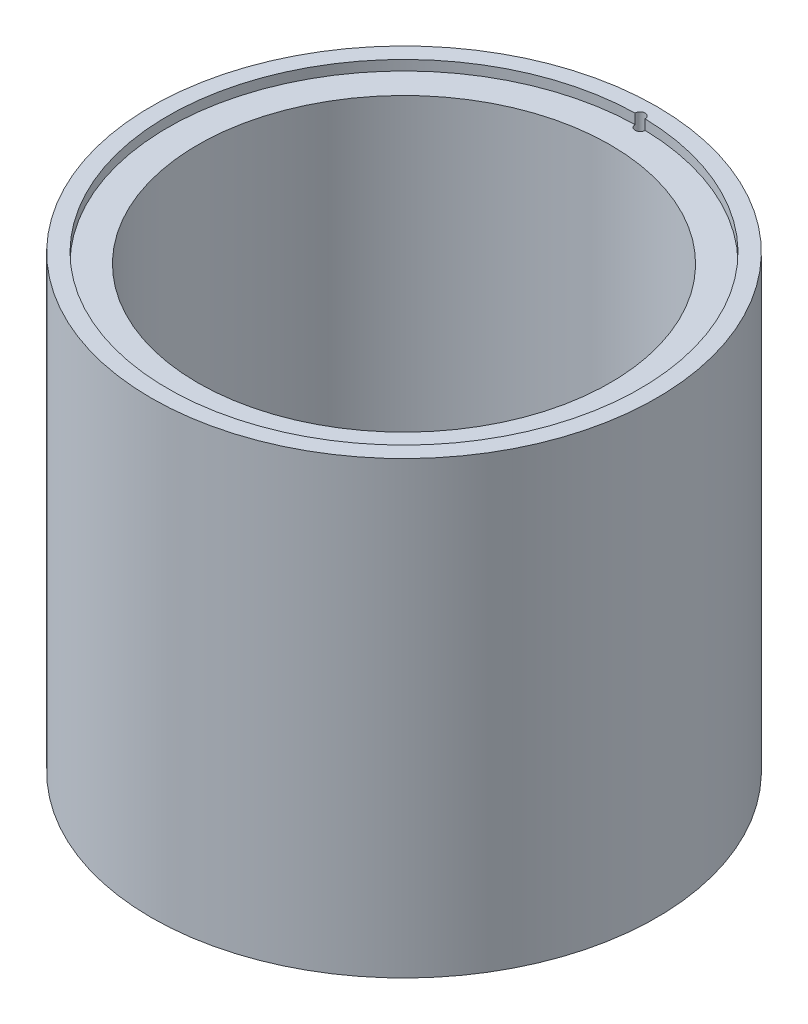
ISO-10303-21;
HEADER;
FILE_DESCRIPTION(('STEP AP214'),'2;1');
FILE_NAME('part.step','',(''),(''),'','','');
FILE_SCHEMA(('AUTOMOTIVE_DESIGN { 1 0 10303 214 1 1 1 1 }'));
ENDSEC;
DATA;
#1=APPLICATION_CONTEXT('core data for automotive mechanical design processes');
#2=APPLICATION_PROTOCOL_DEFINITION('international standard','automotive_design',2000,#1);
#3=PRODUCT_CONTEXT('',#1,'mechanical');
#4=PRODUCT('Part','Part','',(#3));
#5=PRODUCT_RELATED_PRODUCT_CATEGORY('part','',(#4));
#6=PRODUCT_DEFINITION_FORMATION('','',#4);
#7=PRODUCT_DEFINITION_CONTEXT('part definition',#1,'design');
#8=PRODUCT_DEFINITION('design','',#6,#7);
#9=PRODUCT_DEFINITION_SHAPE('','',#8);
#10=(LENGTH_UNIT() NAMED_UNIT(*) SI_UNIT(.MILLI.,.METRE.));
#11=(NAMED_UNIT(*) PLANE_ANGLE_UNIT() SI_UNIT($,.RADIAN.));
#12=(NAMED_UNIT(*) SI_UNIT($,.STERADIAN.) SOLID_ANGLE_UNIT());
#13=UNCERTAINTY_MEASURE_WITH_UNIT(LENGTH_MEASURE(1.E-05),#10,'distance_accuracy_value','');
#14=(GEOMETRIC_REPRESENTATION_CONTEXT(3) GLOBAL_UNCERTAINTY_ASSIGNED_CONTEXT((#13)) GLOBAL_UNIT_ASSIGNED_CONTEXT((#10,
#11,#12)) REPRESENTATION_CONTEXT('',''));
#15=CARTESIAN_POINT('',(0.,0.,0.));
#16=DIRECTION('',(0.,0.,1.));
#17=DIRECTION('',(1.,0.,0.));
#18=AXIS2_PLACEMENT_3D('',#15,#16,#17);
#19=CARTESIAN_POINT('',(0.,45.,0.));
#20=DIRECTION('',(0.,-1.,0.));
#21=DIRECTION('',(0.,0.,-1.));
#22=AXIS2_PLACEMENT_3D('',#19,#20,#21);
#23=CYLINDRICAL_SURFACE('',#22,20.625);
#24=CARTESIAN_POINT('',(0.,3.5,0.));
#25=DIRECTION('',(0.,-1.,0.));
#26=DIRECTION('',(0.,0.,-1.));
#27=AXIS2_PLACEMENT_3D('',#24,#25,#26);
#28=CIRCLE('',#27,20.625);
#29=CARTESIAN_POINT('',(0.,3.5,-20.625));
#30=VERTEX_POINT('',#29);
#31=EDGE_CURVE('E83',#30,#30,#28,.T.);
#32=ORIENTED_EDGE('',*,*,#31,.T.);
#33=EDGE_LOOP('',(#32));
#34=FACE_BOUND('',#33,.T.);
#35=CARTESIAN_POINT('',(0.,44.,0.));
#36=DIRECTION('',(0.,1.,0.));
#37=DIRECTION('',(0.,0.,1.));
#38=AXIS2_PLACEMENT_3D('',#35,#36,#37);
#39=CIRCLE('',#38,20.625);
#40=CARTESIAN_POINT('',(0.,44.,20.625));
#41=VERTEX_POINT('',#40);
#42=EDGE_CURVE('E75',#41,#41,#39,.T.);
#43=ORIENTED_EDGE('',*,*,#42,.T.);
#44=EDGE_LOOP('',(#43));
#45=FACE_BOUND('',#44,.T.);
#46=ADVANCED_FACE('F33',(#34,#45),#23,.F.);
#47=CARTESIAN_POINT('',(0.,45.,0.));
#48=DIRECTION('',(0.,1.,0.));
#49=DIRECTION('',(0.,0.,1.));
#50=AXIS2_PLACEMENT_3D('',#47,#48,#49);
#51=PLANE('',#50);
#52=CARTESIAN_POINT('',(0.,45.,-23.625));
#53=DIRECTION('',(0.,1.,0.));
#54=DIRECTION('',(0.,0.,1.));
#55=AXIS2_PLACEMENT_3D('',#52,#53,#54);
#56=CIRCLE('',#55,0.5);
#57=CARTESIAN_POINT('',(0.499972004479261,45.,-23.619708994709));
#58=VERTEX_POINT('',#57);
#59=CARTESIAN_POINT('',(-0.499972004479261,45.,-23.619708994709));
#60=VERTEX_POINT('',#59);
#61=EDGE_CURVE('E59',#58,#60,#56,.T.);
#62=ORIENTED_EDGE('',*,*,#61,.F.);
#63=CARTESIAN_POINT('',(0.,45.,0.));
#64=DIRECTION('',(0.,1.,0.));
#65=DIRECTION('',(0.,0.,1.));
#66=AXIS2_PLACEMENT_3D('',#63,#64,#65);
#67=CIRCLE('',#66,23.625);
#68=EDGE_CURVE('E69',#60,#58,#67,.T.);
#69=ORIENTED_EDGE('',*,*,#68,.F.);
#70=EDGE_LOOP('',(#62,#69));
#71=FACE_BOUND('',#70,.T.);
#72=CARTESIAN_POINT('',(0.,45.,0.));
#73=DIRECTION('',(0.,1.,0.));
#74=DIRECTION('',(0.,0.,1.));
#75=AXIS2_PLACEMENT_3D('',#72,#73,#74);
#76=CIRCLE('',#75,25.275);
#77=CARTESIAN_POINT('',(0.,45.,25.275));
#78=VERTEX_POINT('',#77);
#79=EDGE_CURVE('E41',#78,#78,#76,.T.);
#80=ORIENTED_EDGE('',*,*,#79,.T.);
#81=EDGE_LOOP('',(#80));
#82=FACE_BOUND('',#81,.T.);
#83=ADVANCED_FACE('F67',(#71,#82),#51,.T.);
#84=CARTESIAN_POINT('',(0.,0.,0.));
#85=DIRECTION('',(0.,1.,0.));
#86=DIRECTION('',(0.,0.,1.));
#87=AXIS2_PLACEMENT_3D('',#84,#85,#86);
#88=PLANE('',#87);
#89=CARTESIAN_POINT('',(0.,0.,-23.625));
#90=DIRECTION('',(0.,1.,0.));
#91=DIRECTION('',(0.,0.,1.));
#92=AXIS2_PLACEMENT_3D('',#89,#90,#91);
#93=CIRCLE('',#92,0.5);
#94=CARTESIAN_POINT('',(0.,0.,-23.125));
#95=VERTEX_POINT('',#94);
#96=EDGE_CURVE('E73',#95,#95,#93,.T.);
#97=ORIENTED_EDGE('',*,*,#96,.T.);
#98=EDGE_LOOP('',(#97));
#99=FACE_BOUND('',#98,.T.);
#100=CARTESIAN_POINT('',(0.,0.,0.));
#101=DIRECTION('',(0.,-1.,0.));
#102=DIRECTION('',(0.,0.,-1.));
#103=AXIS2_PLACEMENT_3D('',#100,#101,#102);
#104=CIRCLE('',#103,22.625);
#105=CARTESIAN_POINT('',(0.,0.,-22.625));
#106=VERTEX_POINT('',#105);
#107=EDGE_CURVE('E84',#106,#106,#104,.T.);
#108=ORIENTED_EDGE('',*,*,#107,.F.);
#109=EDGE_LOOP('',(#108));
#110=FACE_BOUND('',#109,.T.);
#111=CARTESIAN_POINT('',(0.,0.,0.));
#112=DIRECTION('',(0.,1.,0.));
#113=DIRECTION('',(0.,0.,1.));
#114=AXIS2_PLACEMENT_3D('',#111,#112,#113);
#115=CIRCLE('',#114,25.275);
#116=CARTESIAN_POINT('',(0.,0.,25.275));
#117=VERTEX_POINT('',#116);
#118=EDGE_CURVE('E89',#117,#117,#115,.T.);
#119=ORIENTED_EDGE('',*,*,#118,.F.);
#120=EDGE_LOOP('',(#119));
#121=FACE_BOUND('',#120,.T.);
#122=ADVANCED_FACE('F114',(#99,#110,#121),#88,.F.);
#123=CARTESIAN_POINT('',(0.,45.,0.));
#124=DIRECTION('',(0.,-1.,0.));
#125=DIRECTION('',(0.,0.,-1.));
#126=AXIS2_PLACEMENT_3D('',#123,#124,#125);
#127=CYLINDRICAL_SURFACE('',#126,25.275);
#128=ORIENTED_EDGE('',*,*,#79,.F.);
#129=EDGE_LOOP('',(#128));
#130=FACE_BOUND('',#129,.T.);
#131=ORIENTED_EDGE('',*,*,#118,.T.);
#132=EDGE_LOOP('',(#131));
#133=FACE_BOUND('',#132,.T.);
#134=ADVANCED_FACE('F35',(#130,#133),#127,.T.);
#135=CARTESIAN_POINT('',(0.,3.5,0.));
#136=DIRECTION('',(0.,-1.,0.));
#137=DIRECTION('',(0.,0.,-1.));
#138=AXIS2_PLACEMENT_3D('',#135,#136,#137);
#139=CYLINDRICAL_SURFACE('',#138,22.625);
#140=CARTESIAN_POINT('',(0.,3.5,0.));
#141=DIRECTION('',(0.,-1.,0.));
#142=DIRECTION('',(0.,0.,-1.));
#143=AXIS2_PLACEMENT_3D('',#140,#141,#142);
#144=CIRCLE('',#143,22.625);
#145=CARTESIAN_POINT('',(0.,3.5,-22.625));
#146=VERTEX_POINT('',#145);
#147=EDGE_CURVE('E80',#146,#146,#144,.T.);
#148=ORIENTED_EDGE('',*,*,#147,.F.);
#149=EDGE_LOOP('',(#148));
#150=FACE_BOUND('',#149,.T.);
#151=ORIENTED_EDGE('',*,*,#107,.T.);
#152=EDGE_LOOP('',(#151));
#153=FACE_BOUND('',#152,.T.);
#154=ADVANCED_FACE('F117',(#150,#153),#139,.F.);
#155=CARTESIAN_POINT('',(0.,3.5,0.));
#156=DIRECTION('',(0.,-1.,0.));
#157=DIRECTION('',(0.,0.,-1.));
#158=AXIS2_PLACEMENT_3D('',#155,#156,#157);
#159=PLANE('',#158);
#160=ORIENTED_EDGE('',*,*,#31,.F.);
#161=EDGE_LOOP('',(#160));
#162=FACE_BOUND('',#161,.T.);
#163=ORIENTED_EDGE('',*,*,#147,.T.);
#164=EDGE_LOOP('',(#163));
#165=FACE_BOUND('',#164,.T.);
#166=ADVANCED_FACE('F106',(#162,#165),#159,.T.);
#167=CARTESIAN_POINT('',(0.,44.,0.));
#168=DIRECTION('',(0.,1.,0.));
#169=DIRECTION('',(0.,0.,1.));
#170=AXIS2_PLACEMENT_3D('',#167,#168,#169);
#171=CYLINDRICAL_SURFACE('',#170,23.625);
#172=CARTESIAN_POINT('',(0.,44.,0.));
#173=DIRECTION('',(0.,1.,0.));
#174=DIRECTION('',(0.,0.,1.));
#175=AXIS2_PLACEMENT_3D('',#172,#173,#174);
#176=CIRCLE('',#175,23.625);
#177=CARTESIAN_POINT('',(-0.499972004479222,44.,-23.619708994709));
#178=VERTEX_POINT('',#177);
#179=CARTESIAN_POINT('',(0.499972004479222,44.,-23.619708994709));
#180=VERTEX_POINT('',#179);
#181=EDGE_CURVE('E72',#178,#180,#176,.T.);
#182=ORIENTED_EDGE('',*,*,#181,.F.);
#183=DIRECTION('',(0.,1.,0.));
#184=VECTOR('',#183,1.);
#185=CARTESIAN_POINT('',(-0.499972004479261,21.25,-23.619708994709));
#186=LINE('',#185,#184);
#187=EDGE_CURVE('E47',#178,#60,#186,.T.);
#188=ORIENTED_EDGE('',*,*,#187,.T.);
#189=ORIENTED_EDGE('',*,*,#68,.T.);
#190=DIRECTION('',(0.,1.,0.));
#191=VECTOR('',#190,1.);
#192=CARTESIAN_POINT('',(0.499972004479261,21.25,-23.619708994709));
#193=LINE('',#192,#191);
#194=EDGE_CURVE('E55',#58,#180,#193,.F.);
#195=ORIENTED_EDGE('',*,*,#194,.T.);
#196=EDGE_LOOP('',(#182,#188,#189,#195));
#197=FACE_BOUND('',#196,.T.);
#198=ADVANCED_FACE('F71',(#197),#171,.F.);
#199=CARTESIAN_POINT('',(0.,44.,0.));
#200=DIRECTION('',(0.,1.,0.));
#201=DIRECTION('',(0.,0.,1.));
#202=AXIS2_PLACEMENT_3D('',#199,#200,#201);
#203=PLANE('',#202);
#204=CARTESIAN_POINT('',(0.,44.,-23.625));
#205=DIRECTION('',(0.,1.,0.));
#206=DIRECTION('',(0.,0.,1.));
#207=AXIS2_PLACEMENT_3D('',#204,#205,#206);
#208=CIRCLE('',#207,0.5);
#209=EDGE_CURVE('E11',#178,#180,#208,.T.);
#210=ORIENTED_EDGE('',*,*,#209,.F.);
#211=ORIENTED_EDGE('',*,*,#181,.T.);
#212=EDGE_LOOP('',(#210,#211));
#213=FACE_BOUND('',#212,.T.);
#214=ORIENTED_EDGE('',*,*,#42,.F.);
#215=EDGE_LOOP('',(#214));
#216=FACE_BOUND('',#215,.T.);
#217=ADVANCED_FACE('F97',(#213,#216),#203,.T.);
#218=CARTESIAN_POINT('',(0.,-2.5,-23.625));
#219=DIRECTION('',(0.,1.,0.));
#220=DIRECTION('',(0.,0.,1.));
#221=AXIS2_PLACEMENT_3D('',#218,#219,#220);
#222=CYLINDRICAL_SURFACE('',#221,0.5);
#223=ORIENTED_EDGE('',*,*,#209,.T.);
#224=ORIENTED_EDGE('',*,*,#194,.F.);
#225=ORIENTED_EDGE('',*,*,#61,.T.);
#226=ORIENTED_EDGE('',*,*,#187,.F.);
#227=EDGE_LOOP('',(#223,#224,#225,#226));
#228=FACE_BOUND('',#227,.T.);
#229=ORIENTED_EDGE('',*,*,#96,.F.);
#230=EDGE_LOOP('',(#229));
#231=FACE_BOUND('',#230,.T.);
#232=ADVANCED_FACE('F57',(#228,#231),#222,.F.);
#233=CLOSED_SHELL('',(#46,#83,#122,#134,#154,#166,#198,#217,#232));
#234=MANIFOLD_SOLID_BREP('B2',#233);
#235=ADVANCED_BREP_SHAPE_REPRESENTATION('',(#18,#234),#14);
#236=SHAPE_DEFINITION_REPRESENTATION(#9,#235);
ENDSEC;
END-ISO-10303-21;
